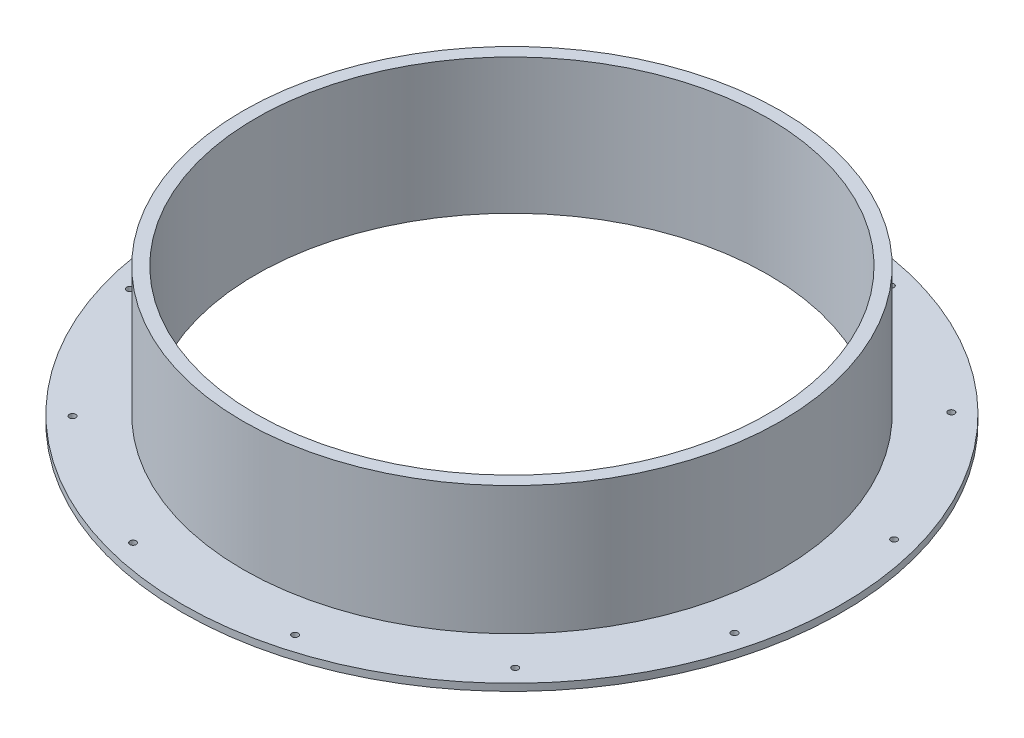
ISO-10303-21;
HEADER;
FILE_DESCRIPTION(('STEP AP214'),'2;1');
FILE_NAME('part.step','',(''),(''),'','','');
FILE_SCHEMA(('AUTOMOTIVE_DESIGN { 1 0 10303 214 1 1 1 1 }'));
ENDSEC;
DATA;
#1=APPLICATION_CONTEXT('core data for automotive mechanical design processes');
#2=APPLICATION_PROTOCOL_DEFINITION('international standard','automotive_design',2000,#1);
#3=PRODUCT_CONTEXT('',#1,'mechanical');
#4=PRODUCT('Part','Part','',(#3));
#5=PRODUCT_RELATED_PRODUCT_CATEGORY('part','',(#4));
#6=PRODUCT_DEFINITION_FORMATION('','',#4);
#7=PRODUCT_DEFINITION_CONTEXT('part definition',#1,'design');
#8=PRODUCT_DEFINITION('design','',#6,#7);
#9=PRODUCT_DEFINITION_SHAPE('','',#8);
#10=(LENGTH_UNIT() NAMED_UNIT(*) SI_UNIT(.MILLI.,.METRE.));
#11=(NAMED_UNIT(*) PLANE_ANGLE_UNIT() SI_UNIT($,.RADIAN.));
#12=(NAMED_UNIT(*) SI_UNIT($,.STERADIAN.) SOLID_ANGLE_UNIT());
#13=UNCERTAINTY_MEASURE_WITH_UNIT(LENGTH_MEASURE(1.E-05),#10,'distance_accuracy_value','');
#14=(GEOMETRIC_REPRESENTATION_CONTEXT(3) GLOBAL_UNCERTAINTY_ASSIGNED_CONTEXT((#13)) GLOBAL_UNIT_ASSIGNED_CONTEXT((#10,
#11,#12)) REPRESENTATION_CONTEXT('',''));
#15=CARTESIAN_POINT('',(0.,0.,0.));
#16=DIRECTION('',(0.,0.,1.));
#17=DIRECTION('',(1.,0.,0.));
#18=AXIS2_PLACEMENT_3D('',#15,#16,#17);
#19=CARTESIAN_POINT('',(0.,20.14,0.));
#20=DIRECTION('',(0.,-1.,0.));
#21=DIRECTION('',(0.,0.,-1.));
#22=AXIS2_PLACEMENT_3D('',#19,#20,#21);
#23=CYLINDRICAL_SURFACE('',#22,40.005);
#24=CARTESIAN_POINT('',(0.,1.05,0.));
#25=DIRECTION('',(0.,1.,0.));
#26=DIRECTION('',(0.,0.,1.));
#27=AXIS2_PLACEMENT_3D('',#24,#25,#26);
#28=CIRCLE('',#27,40.005);
#29=CARTESIAN_POINT('',(0.,1.05,40.005));
#30=VERTEX_POINT('',#29);
#31=EDGE_CURVE('E52',#30,#30,#28,.T.);
#32=ORIENTED_EDGE('',*,*,#31,.T.);
#33=EDGE_LOOP('',(#32));
#34=FACE_BOUND('',#33,.T.);
#35=CARTESIAN_POINT('',(0.,20.14,0.));
#36=DIRECTION('',(0.,1.,0.));
#37=DIRECTION('',(0.,0.,1.));
#38=AXIS2_PLACEMENT_3D('',#35,#36,#37);
#39=CIRCLE('',#38,40.005);
#40=CARTESIAN_POINT('',(0.,20.14,40.005));
#41=VERTEX_POINT('',#40);
#42=EDGE_CURVE('E10',#41,#41,#39,.T.);
#43=ORIENTED_EDGE('',*,*,#42,.F.);
#44=EDGE_LOOP('',(#43));
#45=FACE_BOUND('',#44,.T.);
#46=ADVANCED_FACE('F42',(#34,#45),#23,.T.);
#47=CARTESIAN_POINT('',(0.,20.14,0.));
#48=DIRECTION('',(0.,1.,0.));
#49=DIRECTION('',(0.,0.,1.));
#50=AXIS2_PLACEMENT_3D('',#47,#48,#49);
#51=PLANE('',#50);
#52=CARTESIAN_POINT('',(0.,20.14,0.));
#53=DIRECTION('',(0.,1.,0.));
#54=DIRECTION('',(0.,0.,1.));
#55=AXIS2_PLACEMENT_3D('',#52,#53,#54);
#56=CIRCLE('',#55,38.1);
#57=CARTESIAN_POINT('',(0.,20.14,38.1));
#58=VERTEX_POINT('',#57);
#59=EDGE_CURVE('E48',#58,#58,#56,.T.);
#60=ORIENTED_EDGE('',*,*,#59,.F.);
#61=EDGE_LOOP('',(#60));
#62=FACE_BOUND('',#61,.T.);
#63=ORIENTED_EDGE('',*,*,#42,.T.);
#64=EDGE_LOOP('',(#63));
#65=FACE_BOUND('',#64,.T.);
#66=ADVANCED_FACE('F176',(#62,#65),#51,.T.);
#67=CARTESIAN_POINT('',(0.,0.,0.));
#68=DIRECTION('',(0.,1.,0.));
#69=DIRECTION('',(0.,0.,1.));
#70=AXIS2_PLACEMENT_3D('',#67,#68,#69);
#71=CYLINDRICAL_SURFACE('',#70,38.1);
#72=ORIENTED_EDGE('',*,*,#59,.T.);
#73=EDGE_LOOP('',(#72));
#74=FACE_BOUND('',#73,.T.);
#75=CARTESIAN_POINT('',(0.,0.,0.));
#76=DIRECTION('',(0.,1.,0.));
#77=DIRECTION('',(0.,0.,1.));
#78=AXIS2_PLACEMENT_3D('',#75,#76,#77);
#79=CIRCLE('',#78,38.1);
#80=CARTESIAN_POINT('',(0.,0.,38.1));
#81=VERTEX_POINT('',#80);
#82=EDGE_CURVE('E62',#81,#81,#79,.T.);
#83=ORIENTED_EDGE('',*,*,#82,.F.);
#84=EDGE_LOOP('',(#83));
#85=FACE_BOUND('',#84,.T.);
#86=ADVANCED_FACE('F146',(#74,#85),#71,.F.);
#87=CARTESIAN_POINT('',(0.,1.05,0.));
#88=DIRECTION('',(0.,1.,0.));
#89=DIRECTION('',(0.,0.,1.));
#90=AXIS2_PLACEMENT_3D('',#87,#88,#89);
#91=PLANE('',#90);
#92=CARTESIAN_POINT('',(-12.2988590846103,1.05,-44.5595819210085));
#93=DIRECTION('',(0.,1.,0.));
#94=DIRECTION('',(0.,0.,1.));
#95=AXIS2_PLACEMENT_3D('',#92,#93,#94);
#96=CIRCLE('',#95,0.474999999999988);
#97=CARTESIAN_POINT('',(-12.2988590846103,1.05,-44.0845819210085));
#98=VERTEX_POINT('',#97);
#99=EDGE_CURVE('E136',#98,#98,#96,.T.);
#100=ORIENTED_EDGE('',*,*,#99,.F.);
#101=EDGE_LOOP('',(#100));
#102=FACE_BOUND('',#101,.T.);
#103=CARTESIAN_POINT('',(11.6286661473538,1.05,-44.7391569819212));
#104=DIRECTION('',(0.,1.,0.));
#105=DIRECTION('',(0.,0.,1.));
#106=AXIS2_PLACEMENT_3D('',#103,#104,#105);
#107=CIRCLE('',#106,0.474999999999988);
#108=CARTESIAN_POINT('',(11.6286661473538,1.05,-44.2641569819212));
#109=VERTEX_POINT('',#108);
#110=EDGE_CURVE('E130',#109,#109,#107,.T.);
#111=ORIENTED_EDGE('',*,*,#110,.F.);
#112=EDGE_LOOP('',(#111));
#113=FACE_BOUND('',#112,.T.);
#114=CARTESIAN_POINT('',(32.4403025780261,1.05,-32.9309144614474));
#115=DIRECTION('',(0.,1.,0.));
#116=DIRECTION('',(0.,0.,1.));
#117=AXIS2_PLACEMENT_3D('',#114,#115,#116);
#118=CIRCLE('',#117,0.474999999999989);
#119=CARTESIAN_POINT('',(32.4403025780261,1.05,-32.4559144614474));
#120=VERTEX_POINT('',#119);
#121=EDGE_CURVE('E124',#120,#120,#118,.T.);
#122=ORIENTED_EDGE('',*,*,#121,.F.);
#123=EDGE_LOOP('',(#122));
#124=FACE_BOUND('',#123,.T.);
#125=CARTESIAN_POINT('',(44.5595780433189,1.05,-12.2988573240311));
#126=DIRECTION('',(0.,1.,0.));
#127=DIRECTION('',(0.,0.,1.));
#128=AXIS2_PLACEMENT_3D('',#125,#126,#127);
#129=CIRCLE('',#128,0.474999999999989);
#130=CARTESIAN_POINT('',(44.5595780433189,1.05,-11.8238573240311));
#131=VERTEX_POINT('',#130);
#132=EDGE_CURVE('E118',#131,#131,#129,.T.);
#133=ORIENTED_EDGE('',*,*,#132,.F.);
#134=EDGE_LOOP('',(#133));
#135=FACE_BOUND('',#134,.T.);
#136=CARTESIAN_POINT('',(44.7391593270255,1.05,11.6286658458481));
#137=DIRECTION('',(0.,1.,0.));
#138=DIRECTION('',(0.,0.,1.));
#139=AXIS2_PLACEMENT_3D('',#136,#137,#138);
#140=CIRCLE('',#139,0.474999999999989);
#141=CARTESIAN_POINT('',(44.7391593270255,1.05,12.1036658458481));
#142=VERTEX_POINT('',#141);
#143=EDGE_CURVE('E112',#142,#142,#140,.T.);
#144=ORIENTED_EDGE('',*,*,#143,.F.);
#145=EDGE_LOOP('',(#144));
#146=FACE_BOUND('',#145,.T.);
#147=CARTESIAN_POINT('',(32.9309139687943,1.05,32.4403025655589));
#148=DIRECTION('',(0.,1.,0.));
#149=DIRECTION('',(0.,0.,1.));
#150=AXIS2_PLACEMENT_3D('',#147,#148,#149);
#151=CIRCLE('',#150,0.474999999999989);
#152=CARTESIAN_POINT('',(32.9309139687943,1.05,32.9153025655589));
#153=VERTEX_POINT('',#152);
#154=EDGE_CURVE('E106',#153,#153,#151,.T.);
#155=ORIENTED_EDGE('',*,*,#154,.F.);
#156=EDGE_LOOP('',(#155));
#157=FACE_BOUND('',#156,.T.);
#158=CARTESIAN_POINT('',(12.2988586101851,1.05,44.5595792419998));
#159=DIRECTION('',(0.,1.,0.));
#160=DIRECTION('',(0.,0.,1.));
#161=AXIS2_PLACEMENT_3D('',#158,#159,#160);
#162=CIRCLE('',#161,0.474999999999988);
#163=CARTESIAN_POINT('',(12.2988586101851,1.05,45.0345792419998));
#164=VERTEX_POINT('',#163);
#165=EDGE_CURVE('E100',#164,#164,#162,.T.);
#166=ORIENTED_EDGE('',*,*,#165,.F.);
#167=EDGE_LOOP('',(#166));
#168=FACE_BOUND('',#167,.T.);
#169=CARTESIAN_POINT('',(-11.6286661719334,1.05,44.7391564037641));
#170=DIRECTION('',(0.,1.,0.));
#171=DIRECTION('',(0.,0.,1.));
#172=AXIS2_PLACEMENT_3D('',#169,#170,#171);
#173=CIRCLE('',#172,0.474999999999988);
#174=CARTESIAN_POINT('',(-11.6286661719334,1.05,45.2141564037641));
#175=VERTEX_POINT('',#174);
#176=EDGE_CURVE('E94',#175,#175,#173,.T.);
#177=ORIENTED_EDGE('',*,*,#176,.F.);
#178=EDGE_LOOP('',(#177));
#179=FACE_BOUND('',#178,.T.);
#180=CARTESIAN_POINT('',(-32.4403026321378,1.05,32.9309150687852));
#181=DIRECTION('',(0.,1.,0.));
#182=DIRECTION('',(0.,0.,1.));
#183=AXIS2_PLACEMENT_3D('',#180,#181,#182);
#184=CIRCLE('',#183,0.474999999999989);
#185=CARTESIAN_POINT('',(-32.4403026321378,1.05,33.4059150687852));
#186=VERTEX_POINT('',#185);
#187=EDGE_CURVE('E88',#186,#186,#184,.T.);
#188=ORIENTED_EDGE('',*,*,#187,.F.);
#189=EDGE_LOOP('',(#188));
#190=FACE_BOUND('',#189,.T.);
#191=CARTESIAN_POINT('',(-44.5595825557123,1.05,12.2988589698772));
#192=DIRECTION('',(0.,1.,0.));
#193=DIRECTION('',(0.,0.,1.));
#194=AXIS2_PLACEMENT_3D('',#191,#192,#193);
#195=CIRCLE('',#194,0.474999999999989);
#196=CARTESIAN_POINT('',(-44.5595825557123,1.05,12.7738589698771));
#197=VERTEX_POINT('',#196);
#198=EDGE_CURVE('E82',#197,#197,#195,.T.);
#199=ORIENTED_EDGE('',*,*,#198,.F.);
#200=EDGE_LOOP('',(#199));
#201=FACE_BOUND('',#200,.T.);
#202=CARTESIAN_POINT('',(-44.7391609259245,1.05,-11.6286661582363));
#203=DIRECTION('',(0.,1.,0.));
#204=DIRECTION('',(0.,0.,1.));
#205=AXIS2_PLACEMENT_3D('',#202,#203,#204);
#206=CIRCLE('',#205,0.474999999999989);
#207=CARTESIAN_POINT('',(-44.7391609259245,1.05,-11.1536661582363));
#208=VERTEX_POINT('',#207);
#209=EDGE_CURVE('E76',#208,#208,#206,.T.);
#210=ORIENTED_EDGE('',*,*,#209,.F.);
#211=EDGE_LOOP('',(#210));
#212=FACE_BOUND('',#211,.T.);
#213=CARTESIAN_POINT('',(-32.9309132447452,1.05,-32.4402997790421));
#214=DIRECTION('',(0.,1.,0.));
#215=DIRECTION('',(0.,0.,1.));
#216=AXIS2_PLACEMENT_3D('',#213,#214,#215);
#217=CIRCLE('',#216,0.474999999999989);
#218=CARTESIAN_POINT('',(-32.9309132447452,1.05,-31.9652997790421));
#219=VERTEX_POINT('',#218);
#220=EDGE_CURVE('E70',#219,#219,#217,.T.);
#221=ORIENTED_EDGE('',*,*,#220,.F.);
#222=EDGE_LOOP('',(#221));
#223=FACE_BOUND('',#222,.T.);
#224=CARTESIAN_POINT('',(0.,1.05,0.));
#225=DIRECTION('',(0.,1.,0.));
#226=DIRECTION('',(0.,0.,1.));
#227=AXIS2_PLACEMENT_3D('',#224,#225,#226);
#228=CIRCLE('',#227,49.03);
#229=CARTESIAN_POINT('',(0.,1.05,49.03));
#230=VERTEX_POINT('',#229);
#231=EDGE_CURVE('E56',#230,#230,#228,.T.);
#232=ORIENTED_EDGE('',*,*,#231,.T.);
#233=EDGE_LOOP('',(#232));
#234=FACE_BOUND('',#233,.T.);
#235=ORIENTED_EDGE('',*,*,#31,.F.);
#236=EDGE_LOOP('',(#235));
#237=FACE_BOUND('',#236,.T.);
#238=ADVANCED_FACE('F142',(#102,#113,#124,#135,#146,#157,#168,#179,#190,#201,#212,#223,#234,
#237),#91,.T.);
#239=CARTESIAN_POINT('',(0.,1.05,0.));
#240=DIRECTION('',(0.,-1.,0.));
#241=DIRECTION('',(0.,0.,-1.));
#242=AXIS2_PLACEMENT_3D('',#239,#240,#241);
#243=CYLINDRICAL_SURFACE('',#242,49.03);
#244=ORIENTED_EDGE('',*,*,#231,.F.);
#245=EDGE_LOOP('',(#244));
#246=FACE_BOUND('',#245,.T.);
#247=CARTESIAN_POINT('',(0.,0.,0.));
#248=DIRECTION('',(0.,1.,0.));
#249=DIRECTION('',(0.,0.,1.));
#250=AXIS2_PLACEMENT_3D('',#247,#248,#249);
#251=CIRCLE('',#250,49.03);
#252=CARTESIAN_POINT('',(0.,0.,49.03));
#253=VERTEX_POINT('',#252);
#254=EDGE_CURVE('E59',#253,#253,#251,.T.);
#255=ORIENTED_EDGE('',*,*,#254,.T.);
#256=EDGE_LOOP('',(#255));
#257=FACE_BOUND('',#256,.T.);
#258=ADVANCED_FACE('F145',(#246,#257),#243,.T.);
#259=CARTESIAN_POINT('',(0.,0.,0.));
#260=DIRECTION('',(0.,1.,0.));
#261=DIRECTION('',(0.,0.,1.));
#262=AXIS2_PLACEMENT_3D('',#259,#260,#261);
#263=PLANE('',#262);
#264=CARTESIAN_POINT('',(-12.2988590846103,0.,-44.5595819210085));
#265=DIRECTION('',(0.,1.,0.));
#266=DIRECTION('',(0.,0.,1.));
#267=AXIS2_PLACEMENT_3D('',#264,#265,#266);
#268=CIRCLE('',#267,0.474999999999998);
#269=CARTESIAN_POINT('',(-12.2988590846103,0.,-44.0845819210085));
#270=VERTEX_POINT('',#269);
#271=EDGE_CURVE('E133',#270,#270,#268,.T.);
#272=ORIENTED_EDGE('',*,*,#271,.T.);
#273=EDGE_LOOP('',(#272));
#274=FACE_BOUND('',#273,.T.);
#275=CARTESIAN_POINT('',(11.6286661473538,0.,-44.7391569819212));
#276=DIRECTION('',(0.,1.,0.));
#277=DIRECTION('',(0.,0.,1.));
#278=AXIS2_PLACEMENT_3D('',#275,#276,#277);
#279=CIRCLE('',#278,0.474999999999998);
#280=CARTESIAN_POINT('',(11.6286661473538,0.,-44.2641569819212));
#281=VERTEX_POINT('',#280);
#282=EDGE_CURVE('E127',#281,#281,#279,.T.);
#283=ORIENTED_EDGE('',*,*,#282,.T.);
#284=EDGE_LOOP('',(#283));
#285=FACE_BOUND('',#284,.T.);
#286=CARTESIAN_POINT('',(32.4403025780261,0.,-32.9309144614474));
#287=DIRECTION('',(0.,1.,0.));
#288=DIRECTION('',(0.,0.,1.));
#289=AXIS2_PLACEMENT_3D('',#286,#287,#288);
#290=CIRCLE('',#289,0.474999999999996);
#291=CARTESIAN_POINT('',(32.4403025780261,0.,-32.4559144614474));
#292=VERTEX_POINT('',#291);
#293=EDGE_CURVE('E121',#292,#292,#290,.T.);
#294=ORIENTED_EDGE('',*,*,#293,.T.);
#295=EDGE_LOOP('',(#294));
#296=FACE_BOUND('',#295,.T.);
#297=CARTESIAN_POINT('',(44.5595780433189,0.,-12.2988573240311));
#298=DIRECTION('',(0.,1.,0.));
#299=DIRECTION('',(0.,0.,1.));
#300=AXIS2_PLACEMENT_3D('',#297,#298,#299);
#301=CIRCLE('',#300,0.474999999999996);
#302=CARTESIAN_POINT('',(44.5595780433189,0.,-11.8238573240311));
#303=VERTEX_POINT('',#302);
#304=EDGE_CURVE('E115',#303,#303,#301,.T.);
#305=ORIENTED_EDGE('',*,*,#304,.T.);
#306=EDGE_LOOP('',(#305));
#307=FACE_BOUND('',#306,.T.);
#308=CARTESIAN_POINT('',(44.7391593270255,0.,11.6286658458481));
#309=DIRECTION('',(0.,1.,0.));
#310=DIRECTION('',(0.,0.,1.));
#311=AXIS2_PLACEMENT_3D('',#308,#309,#310);
#312=CIRCLE('',#311,0.474999999999996);
#313=CARTESIAN_POINT('',(44.7391593270255,0.,12.1036658458481));
#314=VERTEX_POINT('',#313);
#315=EDGE_CURVE('E109',#314,#314,#312,.T.);
#316=ORIENTED_EDGE('',*,*,#315,.T.);
#317=EDGE_LOOP('',(#316));
#318=FACE_BOUND('',#317,.T.);
#319=CARTESIAN_POINT('',(32.9309139687943,0.,32.4403025655589));
#320=DIRECTION('',(0.,1.,0.));
#321=DIRECTION('',(0.,0.,1.));
#322=AXIS2_PLACEMENT_3D('',#319,#320,#321);
#323=CIRCLE('',#322,0.474999999999996);
#324=CARTESIAN_POINT('',(32.9309139687943,0.,32.9153025655589));
#325=VERTEX_POINT('',#324);
#326=EDGE_CURVE('E103',#325,#325,#323,.T.);
#327=ORIENTED_EDGE('',*,*,#326,.T.);
#328=EDGE_LOOP('',(#327));
#329=FACE_BOUND('',#328,.T.);
#330=CARTESIAN_POINT('',(12.2988586101851,0.,44.5595792419998));
#331=DIRECTION('',(0.,1.,0.));
#332=DIRECTION('',(0.,0.,1.));
#333=AXIS2_PLACEMENT_3D('',#330,#331,#332);
#334=CIRCLE('',#333,0.474999999999998);
#335=CARTESIAN_POINT('',(12.2988586101851,0.,45.0345792419998));
#336=VERTEX_POINT('',#335);
#337=EDGE_CURVE('E97',#336,#336,#334,.T.);
#338=ORIENTED_EDGE('',*,*,#337,.T.);
#339=EDGE_LOOP('',(#338));
#340=FACE_BOUND('',#339,.T.);
#341=CARTESIAN_POINT('',(-11.6286661719334,0.,44.7391564037641));
#342=DIRECTION('',(0.,1.,0.));
#343=DIRECTION('',(0.,0.,1.));
#344=AXIS2_PLACEMENT_3D('',#341,#342,#343);
#345=CIRCLE('',#344,0.474999999999998);
#346=CARTESIAN_POINT('',(-11.6286661719334,0.,45.2141564037641));
#347=VERTEX_POINT('',#346);
#348=EDGE_CURVE('E91',#347,#347,#345,.T.);
#349=ORIENTED_EDGE('',*,*,#348,.T.);
#350=EDGE_LOOP('',(#349));
#351=FACE_BOUND('',#350,.T.);
#352=CARTESIAN_POINT('',(-32.4403026321378,0.,32.9309150687852));
#353=DIRECTION('',(0.,1.,0.));
#354=DIRECTION('',(0.,0.,1.));
#355=AXIS2_PLACEMENT_3D('',#352,#353,#354);
#356=CIRCLE('',#355,0.474999999999996);
#357=CARTESIAN_POINT('',(-32.4403026321378,0.,33.4059150687852));
#358=VERTEX_POINT('',#357);
#359=EDGE_CURVE('E85',#358,#358,#356,.T.);
#360=ORIENTED_EDGE('',*,*,#359,.T.);
#361=EDGE_LOOP('',(#360));
#362=FACE_BOUND('',#361,.T.);
#363=CARTESIAN_POINT('',(-44.5595825557123,0.,12.2988589698772));
#364=DIRECTION('',(0.,1.,0.));
#365=DIRECTION('',(0.,0.,1.));
#366=AXIS2_PLACEMENT_3D('',#363,#364,#365);
#367=CIRCLE('',#366,0.474999999999996);
#368=CARTESIAN_POINT('',(-44.5595825557123,0.,12.7738589698771));
#369=VERTEX_POINT('',#368);
#370=EDGE_CURVE('E79',#369,#369,#367,.T.);
#371=ORIENTED_EDGE('',*,*,#370,.T.);
#372=EDGE_LOOP('',(#371));
#373=FACE_BOUND('',#372,.T.);
#374=CARTESIAN_POINT('',(-44.7391609259245,0.,-11.6286661582363));
#375=DIRECTION('',(0.,1.,0.));
#376=DIRECTION('',(0.,0.,1.));
#377=AXIS2_PLACEMENT_3D('',#374,#375,#376);
#378=CIRCLE('',#377,0.474999999999996);
#379=CARTESIAN_POINT('',(-44.7391609259245,0.,-11.1536661582363));
#380=VERTEX_POINT('',#379);
#381=EDGE_CURVE('E73',#380,#380,#378,.T.);
#382=ORIENTED_EDGE('',*,*,#381,.T.);
#383=EDGE_LOOP('',(#382));
#384=FACE_BOUND('',#383,.T.);
#385=CARTESIAN_POINT('',(-32.9309132447452,0.,-32.4402997790421));
#386=DIRECTION('',(0.,1.,0.));
#387=DIRECTION('',(0.,0.,1.));
#388=AXIS2_PLACEMENT_3D('',#385,#386,#387);
#389=CIRCLE('',#388,0.474999999999996);
#390=CARTESIAN_POINT('',(-32.9309132447452,0.,-31.9652997790421));
#391=VERTEX_POINT('',#390);
#392=EDGE_CURVE('E67',#391,#391,#389,.T.);
#393=ORIENTED_EDGE('',*,*,#392,.T.);
#394=EDGE_LOOP('',(#393));
#395=FACE_BOUND('',#394,.T.);
#396=ORIENTED_EDGE('',*,*,#82,.T.);
#397=EDGE_LOOP('',(#396));
#398=FACE_BOUND('',#397,.T.);
#399=ORIENTED_EDGE('',*,*,#254,.F.);
#400=EDGE_LOOP('',(#399));
#401=FACE_BOUND('',#400,.T.);
#402=ADVANCED_FACE('F187',(#274,#285,#296,#307,#318,#329,#340,#351,#362,#373,#384,#395,#398,
#401),#263,.F.);
#403=CARTESIAN_POINT('',(-32.9309132447452,1.05,-32.4402997790421));
#404=DIRECTION('',(0.,1.,0.));
#405=DIRECTION('',(0.,0.,1.));
#406=AXIS2_PLACEMENT_3D('',#403,#404,#405);
#407=CYLINDRICAL_SURFACE('',#406,0.474999999999993);
#408=ORIENTED_EDGE('',*,*,#392,.F.);
#409=EDGE_LOOP('',(#408));
#410=FACE_BOUND('',#409,.T.);
#411=ORIENTED_EDGE('',*,*,#220,.T.);
#412=EDGE_LOOP('',(#411));
#413=FACE_BOUND('',#412,.T.);
#414=ADVANCED_FACE('F189',(#410,#413),#407,.F.);
#415=CARTESIAN_POINT('',(-44.7391609259245,1.05,-11.6286661582363));
#416=DIRECTION('',(0.,1.,0.));
#417=DIRECTION('',(0.,0.,1.));
#418=AXIS2_PLACEMENT_3D('',#415,#416,#417);
#419=CYLINDRICAL_SURFACE('',#418,0.474999999999993);
#420=ORIENTED_EDGE('',*,*,#381,.F.);
#421=EDGE_LOOP('',(#420));
#422=FACE_BOUND('',#421,.T.);
#423=ORIENTED_EDGE('',*,*,#209,.T.);
#424=EDGE_LOOP('',(#423));
#425=FACE_BOUND('',#424,.T.);
#426=ADVANCED_FACE('F196',(#422,#425),#419,.F.);
#427=CARTESIAN_POINT('',(-44.5595825557123,1.05,12.2988589698772));
#428=DIRECTION('',(0.,1.,0.));
#429=DIRECTION('',(0.,0.,1.));
#430=AXIS2_PLACEMENT_3D('',#427,#428,#429);
#431=CYLINDRICAL_SURFACE('',#430,0.474999999999993);
#432=ORIENTED_EDGE('',*,*,#370,.F.);
#433=EDGE_LOOP('',(#432));
#434=FACE_BOUND('',#433,.T.);
#435=ORIENTED_EDGE('',*,*,#198,.T.);
#436=EDGE_LOOP('',(#435));
#437=FACE_BOUND('',#436,.T.);
#438=ADVANCED_FACE('F233',(#434,#437),#431,.F.);
#439=CARTESIAN_POINT('',(-32.4403026321378,1.05,32.9309150687852));
#440=DIRECTION('',(0.,1.,0.));
#441=DIRECTION('',(0.,0.,1.));
#442=AXIS2_PLACEMENT_3D('',#439,#440,#441);
#443=CYLINDRICAL_SURFACE('',#442,0.474999999999993);
#444=ORIENTED_EDGE('',*,*,#359,.F.);
#445=EDGE_LOOP('',(#444));
#446=FACE_BOUND('',#445,.T.);
#447=ORIENTED_EDGE('',*,*,#187,.T.);
#448=EDGE_LOOP('',(#447));
#449=FACE_BOUND('',#448,.T.);
#450=ADVANCED_FACE('F238',(#446,#449),#443,.F.);
#451=CARTESIAN_POINT('',(-11.6286661719334,1.05,44.7391564037641));
#452=DIRECTION('',(0.,1.,0.));
#453=DIRECTION('',(0.,0.,1.));
#454=AXIS2_PLACEMENT_3D('',#451,#452,#453);
#455=CYLINDRICAL_SURFACE('',#454,0.474999999999993);
#456=ORIENTED_EDGE('',*,*,#348,.F.);
#457=EDGE_LOOP('',(#456));
#458=FACE_BOUND('',#457,.T.);
#459=ORIENTED_EDGE('',*,*,#176,.T.);
#460=EDGE_LOOP('',(#459));
#461=FACE_BOUND('',#460,.T.);
#462=ADVANCED_FACE('F244',(#458,#461),#455,.F.);
#463=CARTESIAN_POINT('',(12.2988586101851,1.05,44.5595792419998));
#464=DIRECTION('',(0.,1.,0.));
#465=DIRECTION('',(0.,0.,1.));
#466=AXIS2_PLACEMENT_3D('',#463,#464,#465);
#467=CYLINDRICAL_SURFACE('',#466,0.474999999999993);
#468=ORIENTED_EDGE('',*,*,#337,.F.);
#469=EDGE_LOOP('',(#468));
#470=FACE_BOUND('',#469,.T.);
#471=ORIENTED_EDGE('',*,*,#165,.T.);
#472=EDGE_LOOP('',(#471));
#473=FACE_BOUND('',#472,.T.);
#474=ADVANCED_FACE('F248',(#470,#473),#467,.F.);
#475=CARTESIAN_POINT('',(32.9309139687943,1.05,32.4403025655589));
#476=DIRECTION('',(0.,1.,0.));
#477=DIRECTION('',(0.,0.,1.));
#478=AXIS2_PLACEMENT_3D('',#475,#476,#477);
#479=CYLINDRICAL_SURFACE('',#478,0.474999999999993);
#480=ORIENTED_EDGE('',*,*,#326,.F.);
#481=EDGE_LOOP('',(#480));
#482=FACE_BOUND('',#481,.T.);
#483=ORIENTED_EDGE('',*,*,#154,.T.);
#484=EDGE_LOOP('',(#483));
#485=FACE_BOUND('',#484,.T.);
#486=ADVANCED_FACE('F252',(#482,#485),#479,.F.);
#487=CARTESIAN_POINT('',(44.7391593270255,1.05,11.6286658458481));
#488=DIRECTION('',(0.,1.,0.));
#489=DIRECTION('',(0.,0.,1.));
#490=AXIS2_PLACEMENT_3D('',#487,#488,#489);
#491=CYLINDRICAL_SURFACE('',#490,0.474999999999993);
#492=ORIENTED_EDGE('',*,*,#315,.F.);
#493=EDGE_LOOP('',(#492));
#494=FACE_BOUND('',#493,.T.);
#495=ORIENTED_EDGE('',*,*,#143,.T.);
#496=EDGE_LOOP('',(#495));
#497=FACE_BOUND('',#496,.T.);
#498=ADVANCED_FACE('F256',(#494,#497),#491,.F.);
#499=CARTESIAN_POINT('',(44.5595780433189,1.05,-12.2988573240311));
#500=DIRECTION('',(0.,1.,0.));
#501=DIRECTION('',(0.,0.,1.));
#502=AXIS2_PLACEMENT_3D('',#499,#500,#501);
#503=CYLINDRICAL_SURFACE('',#502,0.474999999999993);
#504=ORIENTED_EDGE('',*,*,#304,.F.);
#505=EDGE_LOOP('',(#504));
#506=FACE_BOUND('',#505,.T.);
#507=ORIENTED_EDGE('',*,*,#132,.T.);
#508=EDGE_LOOP('',(#507));
#509=FACE_BOUND('',#508,.T.);
#510=ADVANCED_FACE('F260',(#506,#509),#503,.F.);
#511=CARTESIAN_POINT('',(32.4403025780261,1.05,-32.9309144614474));
#512=DIRECTION('',(0.,1.,0.));
#513=DIRECTION('',(0.,0.,1.));
#514=AXIS2_PLACEMENT_3D('',#511,#512,#513);
#515=CYLINDRICAL_SURFACE('',#514,0.474999999999993);
#516=ORIENTED_EDGE('',*,*,#293,.F.);
#517=EDGE_LOOP('',(#516));
#518=FACE_BOUND('',#517,.T.);
#519=ORIENTED_EDGE('',*,*,#121,.T.);
#520=EDGE_LOOP('',(#519));
#521=FACE_BOUND('',#520,.T.);
#522=ADVANCED_FACE('F264',(#518,#521),#515,.F.);
#523=CARTESIAN_POINT('',(11.6286661473538,1.05,-44.7391569819212));
#524=DIRECTION('',(0.,1.,0.));
#525=DIRECTION('',(0.,0.,1.));
#526=AXIS2_PLACEMENT_3D('',#523,#524,#525);
#527=CYLINDRICAL_SURFACE('',#526,0.474999999999993);
#528=ORIENTED_EDGE('',*,*,#282,.F.);
#529=EDGE_LOOP('',(#528));
#530=FACE_BOUND('',#529,.T.);
#531=ORIENTED_EDGE('',*,*,#110,.T.);
#532=EDGE_LOOP('',(#531));
#533=FACE_BOUND('',#532,.T.);
#534=ADVANCED_FACE('F268',(#530,#533),#527,.F.);
#535=CARTESIAN_POINT('',(-12.2988590846103,1.05,-44.5595819210085));
#536=DIRECTION('',(0.,1.,0.));
#537=DIRECTION('',(0.,0.,1.));
#538=AXIS2_PLACEMENT_3D('',#535,#536,#537);
#539=CYLINDRICAL_SURFACE('',#538,0.474999999999993);
#540=ORIENTED_EDGE('',*,*,#271,.F.);
#541=EDGE_LOOP('',(#540));
#542=FACE_BOUND('',#541,.T.);
#543=ORIENTED_EDGE('',*,*,#99,.T.);
#544=EDGE_LOOP('',(#543));
#545=FACE_BOUND('',#544,.T.);
#546=ADVANCED_FACE('F140',(#542,#545),#539,.F.);
#547=CLOSED_SHELL('',(#46,#66,#86,#238,#258,#402,#414,#426,#438,#450,#462,#474,#486,#498,#510,
#522,#534,#546));
#548=MANIFOLD_SOLID_BREP('B2',#547);
#549=ADVANCED_BREP_SHAPE_REPRESENTATION('',(#18,#548),#14);
#550=SHAPE_DEFINITION_REPRESENTATION(#9,#549);
ENDSEC;
END-ISO-10303-21;
